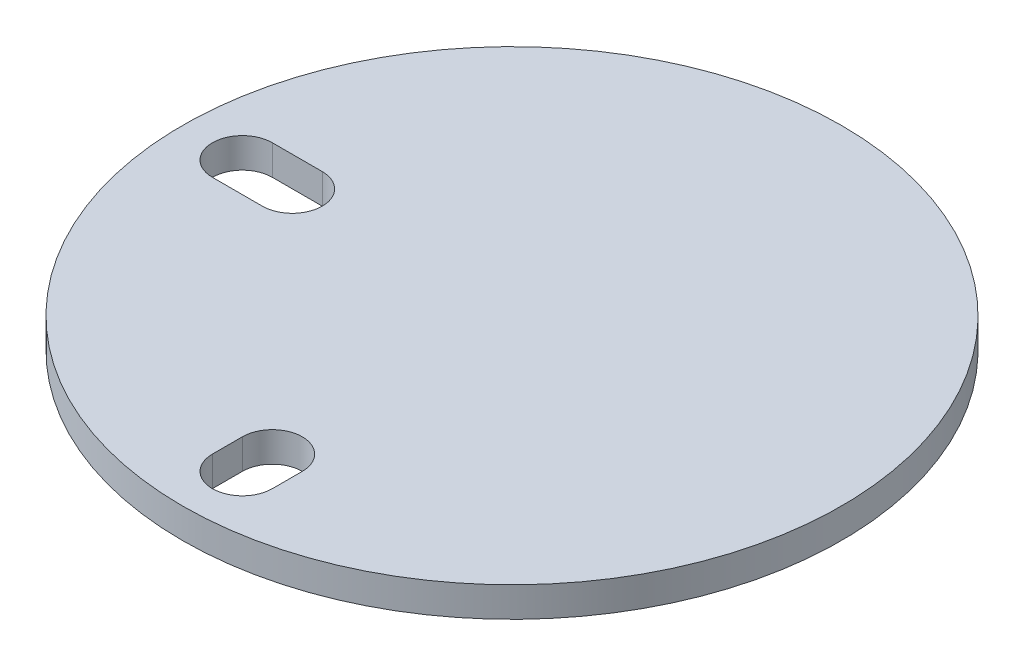
ISO-10303-21;
HEADER;
FILE_DESCRIPTION(('STEP AP214'),'2;1');
FILE_NAME('part.step','',(''),(''),'','','');
FILE_SCHEMA(('AUTOMOTIVE_DESIGN { 1 0 10303 214 1 1 1 1 }'));
ENDSEC;
DATA;
#1=APPLICATION_CONTEXT('core data for automotive mechanical design processes');
#2=APPLICATION_PROTOCOL_DEFINITION('international standard','automotive_design',2000,#1);
#3=PRODUCT_CONTEXT('',#1,'mechanical');
#4=PRODUCT('Part','Part','',(#3));
#5=PRODUCT_RELATED_PRODUCT_CATEGORY('part','',(#4));
#6=PRODUCT_DEFINITION_FORMATION('','',#4);
#7=PRODUCT_DEFINITION_CONTEXT('part definition',#1,'design');
#8=PRODUCT_DEFINITION('design','',#6,#7);
#9=PRODUCT_DEFINITION_SHAPE('','',#8);
#10=(LENGTH_UNIT() NAMED_UNIT(*) SI_UNIT(.MILLI.,.METRE.));
#11=(NAMED_UNIT(*) PLANE_ANGLE_UNIT() SI_UNIT($,.RADIAN.));
#12=(NAMED_UNIT(*) SI_UNIT($,.STERADIAN.) SOLID_ANGLE_UNIT());
#13=UNCERTAINTY_MEASURE_WITH_UNIT(LENGTH_MEASURE(1.E-05),#10,'distance_accuracy_value','');
#14=(GEOMETRIC_REPRESENTATION_CONTEXT(3) GLOBAL_UNCERTAINTY_ASSIGNED_CONTEXT((#13)) GLOBAL_UNIT_ASSIGNED_CONTEXT((#10,
#11,#12)) REPRESENTATION_CONTEXT('',''));
#15=CARTESIAN_POINT('',(0.,0.,0.));
#16=DIRECTION('',(0.,0.,1.));
#17=DIRECTION('',(1.,0.,0.));
#18=AXIS2_PLACEMENT_3D('',#15,#16,#17);
#19=CARTESIAN_POINT('',(0.,3.,0.));
#20=DIRECTION('',(0.,1.,0.));
#21=DIRECTION('',(0.,0.,1.));
#22=AXIS2_PLACEMENT_3D('',#19,#20,#21);
#23=PLANE('',#22);
#24=CARTESIAN_POINT('',(0.,3.,0.));
#25=DIRECTION('',(0.,1.,0.));
#26=DIRECTION('',(0.,0.,1.));
#27=AXIS2_PLACEMENT_3D('',#24,#25,#26);
#28=CIRCLE('',#27,33.);
#29=CARTESIAN_POINT('',(0.,3.,33.));
#30=VERTEX_POINT('',#29);
#31=EDGE_CURVE('E11',#30,#30,#28,.T.);
#32=ORIENTED_EDGE('',*,*,#31,.T.);
#33=EDGE_LOOP('',(#32));
#34=FACE_BOUND('',#33,.T.);
#35=DIRECTION('',(0.999999999033754,0.,-4.39601134094828E-05));
#36=VECTOR('',#35,1.);
#37=CARTESIAN_POINT('',(-27.,3.,3.));
#38=LINE('',#37,#36);
#39=CARTESIAN_POINT('',(-27.,3.,3.));
#40=VERTEX_POINT('',#39);
#41=CARTESIAN_POINT('',(-21.9635532222098,3.,2.99977859722825));
#42=VERTEX_POINT('',#41);
#43=EDGE_CURVE('E136',#40,#42,#38,.T.);
#44=ORIENTED_EDGE('',*,*,#43,.F.);
#45=CARTESIAN_POINT('',(-27.,3.,0.));
#46=DIRECTION('',(0.,1.,0.));
#47=DIRECTION('',(0.,0.,1.));
#48=AXIS2_PLACEMENT_3D('',#45,#46,#47);
#49=CIRCLE('',#48,3.);
#50=CARTESIAN_POINT('',(-27.,3.,-3.));
#51=VERTEX_POINT('',#50);
#52=EDGE_CURVE('E134',#51,#40,#49,.T.);
#53=ORIENTED_EDGE('',*,*,#52,.F.);
#54=DIRECTION('',(-1.,0.,0.));
#55=VECTOR('',#54,1.);
#56=CARTESIAN_POINT('',(-27.,3.,-3.));
#57=LINE('',#56,#55);
#58=CARTESIAN_POINT('',(-22.,3.,-3.));
#59=VERTEX_POINT('',#58);
#60=EDGE_CURVE('E142',#59,#51,#57,.T.);
#61=ORIENTED_EDGE('',*,*,#60,.F.);
#62=CARTESIAN_POINT('',(-22.,3.,0.));
#63=DIRECTION('',(0.,1.,0.));
#64=DIRECTION('',(0.,0.,1.));
#65=AXIS2_PLACEMENT_3D('',#62,#63,#64);
#66=CIRCLE('',#65,3.);
#67=EDGE_CURVE('E139',#42,#59,#66,.T.);
#68=ORIENTED_EDGE('',*,*,#67,.F.);
#69=EDGE_LOOP('',(#44,#53,#61,#68));
#70=FACE_BOUND('',#69,.T.);
#71=DIRECTION('',(0.,0.,-1.));
#72=VECTOR('',#71,1.);
#73=CARTESIAN_POINT('',(3.00000000000001,3.,24.));
#74=LINE('',#73,#72);
#75=CARTESIAN_POINT('',(3.00000000000001,3.,27.));
#76=VERTEX_POINT('',#75);
#77=CARTESIAN_POINT('',(3.00000000000001,3.,24.));
#78=VERTEX_POINT('',#77);
#79=EDGE_CURVE('E106',#76,#78,#74,.T.);
#80=ORIENTED_EDGE('',*,*,#79,.F.);
#81=CARTESIAN_POINT('',(0.,3.,27.));
#82=DIRECTION('',(0.,1.,0.));
#83=DIRECTION('',(0.,0.,1.));
#84=AXIS2_PLACEMENT_3D('',#81,#82,#83);
#85=CIRCLE('',#84,3.);
#86=CARTESIAN_POINT('',(-2.99999999999999,3.,27.));
#87=VERTEX_POINT('',#86);
#88=EDGE_CURVE('E98',#87,#76,#85,.T.);
#89=ORIENTED_EDGE('',*,*,#88,.F.);
#90=DIRECTION('',(0.,0.,1.));
#91=VECTOR('',#90,1.);
#92=CARTESIAN_POINT('',(-2.99999999999999,3.,27.));
#93=LINE('',#92,#91);
#94=CARTESIAN_POINT('',(-2.99999999999999,3.,24.));
#95=VERTEX_POINT('',#94);
#96=EDGE_CURVE('E120',#95,#87,#93,.T.);
#97=ORIENTED_EDGE('',*,*,#96,.F.);
#98=CARTESIAN_POINT('',(0.,3.,24.));
#99=DIRECTION('',(0.,1.,0.));
#100=DIRECTION('',(0.,0.,1.));
#101=AXIS2_PLACEMENT_3D('',#98,#99,#100);
#102=CIRCLE('',#101,3.);
#103=EDGE_CURVE('E118',#78,#95,#102,.T.);
#104=ORIENTED_EDGE('',*,*,#103,.F.);
#105=EDGE_LOOP('',(#80,#89,#97,#104));
#106=FACE_BOUND('',#105,.T.);
#107=ADVANCED_FACE('F33',(#34,#70,#106),#23,.T.);
#108=CARTESIAN_POINT('',(0.,0.,0.));
#109=DIRECTION('',(0.,1.,0.));
#110=DIRECTION('',(0.,0.,1.));
#111=AXIS2_PLACEMENT_3D('',#108,#109,#110);
#112=PLANE('',#111);
#113=CARTESIAN_POINT('',(-27.,0.,0.));
#114=DIRECTION('',(0.,1.,0.));
#115=DIRECTION('',(0.,0.,1.));
#116=AXIS2_PLACEMENT_3D('',#113,#114,#115);
#117=CIRCLE('',#116,3.);
#118=CARTESIAN_POINT('',(-27.,0.,-3.));
#119=VERTEX_POINT('',#118);
#120=CARTESIAN_POINT('',(-27.,0.,3.));
#121=VERTEX_POINT('',#120);
#122=EDGE_CURVE('E114',#119,#121,#117,.T.);
#123=ORIENTED_EDGE('',*,*,#122,.T.);
#124=DIRECTION('',(0.999999999033754,0.,-4.39601134094828E-05));
#125=VECTOR('',#124,1.);
#126=CARTESIAN_POINT('',(-27.,0.,3.));
#127=LINE('',#126,#125);
#128=CARTESIAN_POINT('',(-21.9635532222098,0.,2.99977859722825));
#129=VERTEX_POINT('',#128);
#130=EDGE_CURVE('E147',#121,#129,#127,.T.);
#131=ORIENTED_EDGE('',*,*,#130,.T.);
#132=CARTESIAN_POINT('',(-22.,0.,0.));
#133=DIRECTION('',(0.,1.,0.));
#134=DIRECTION('',(0.,0.,1.));
#135=AXIS2_PLACEMENT_3D('',#132,#133,#134);
#136=CIRCLE('',#135,3.);
#137=CARTESIAN_POINT('',(-22.,0.,-3.));
#138=VERTEX_POINT('',#137);
#139=EDGE_CURVE('E150',#129,#138,#136,.T.);
#140=ORIENTED_EDGE('',*,*,#139,.T.);
#141=DIRECTION('',(-1.,0.,0.));
#142=VECTOR('',#141,1.);
#143=CARTESIAN_POINT('',(-27.,0.,-3.));
#144=LINE('',#143,#142);
#145=EDGE_CURVE('E137',#138,#119,#144,.T.);
#146=ORIENTED_EDGE('',*,*,#145,.T.);
#147=EDGE_LOOP('',(#123,#131,#140,#146));
#148=FACE_BOUND('',#147,.T.);
#149=CARTESIAN_POINT('',(0.,0.,0.));
#150=DIRECTION('',(0.,1.,0.));
#151=DIRECTION('',(0.,0.,1.));
#152=AXIS2_PLACEMENT_3D('',#149,#150,#151);
#153=CIRCLE('',#152,33.);
#154=CARTESIAN_POINT('',(0.,0.,33.));
#155=VERTEX_POINT('',#154);
#156=EDGE_CURVE('E37',#155,#155,#153,.T.);
#157=ORIENTED_EDGE('',*,*,#156,.F.);
#158=EDGE_LOOP('',(#157));
#159=FACE_BOUND('',#158,.T.);
#160=CARTESIAN_POINT('',(0.,0.,27.));
#161=DIRECTION('',(0.,1.,0.));
#162=DIRECTION('',(0.,0.,1.));
#163=AXIS2_PLACEMENT_3D('',#160,#161,#162);
#164=CIRCLE('',#163,3.);
#165=CARTESIAN_POINT('',(-2.99999999999999,0.,27.));
#166=VERTEX_POINT('',#165);
#167=CARTESIAN_POINT('',(3.00000000000001,0.,27.));
#168=VERTEX_POINT('',#167);
#169=EDGE_CURVE('E56',#166,#168,#164,.T.);
#170=ORIENTED_EDGE('',*,*,#169,.T.);
#171=DIRECTION('',(0.,0.,-1.));
#172=VECTOR('',#171,1.);
#173=CARTESIAN_POINT('',(3.00000000000001,0.,24.));
#174=LINE('',#173,#172);
#175=CARTESIAN_POINT('',(3.00000000000001,0.,24.));
#176=VERTEX_POINT('',#175);
#177=EDGE_CURVE('E113',#168,#176,#174,.T.);
#178=ORIENTED_EDGE('',*,*,#177,.T.);
#179=CARTESIAN_POINT('',(0.,0.,24.));
#180=DIRECTION('',(0.,1.,0.));
#181=DIRECTION('',(0.,0.,1.));
#182=AXIS2_PLACEMENT_3D('',#179,#180,#181);
#183=CIRCLE('',#182,3.);
#184=CARTESIAN_POINT('',(-2.99999999999999,0.,24.));
#185=VERTEX_POINT('',#184);
#186=EDGE_CURVE('E126',#176,#185,#183,.T.);
#187=ORIENTED_EDGE('',*,*,#186,.T.);
#188=DIRECTION('',(0.,0.,1.));
#189=VECTOR('',#188,1.);
#190=CARTESIAN_POINT('',(-2.99999999999999,0.,27.));
#191=LINE('',#190,#189);
#192=EDGE_CURVE('E107',#185,#166,#191,.T.);
#193=ORIENTED_EDGE('',*,*,#192,.T.);
#194=EDGE_LOOP('',(#170,#178,#187,#193));
#195=FACE_BOUND('',#194,.T.);
#196=ADVANCED_FACE('F169',(#148,#159,#195),#112,.F.);
#197=CARTESIAN_POINT('',(0.,3.,0.));
#198=DIRECTION('',(0.,-1.,0.));
#199=DIRECTION('',(0.,0.,-1.));
#200=AXIS2_PLACEMENT_3D('',#197,#198,#199);
#201=CYLINDRICAL_SURFACE('',#200,33.);
#202=ORIENTED_EDGE('',*,*,#31,.F.);
#203=EDGE_LOOP('',(#202));
#204=FACE_BOUND('',#203,.T.);
#205=ORIENTED_EDGE('',*,*,#156,.T.);
#206=EDGE_LOOP('',(#205));
#207=FACE_BOUND('',#206,.T.);
#208=ADVANCED_FACE('F35',(#204,#207),#201,.T.);
#209=CARTESIAN_POINT('',(-27.,3.,0.));
#210=DIRECTION('',(0.,-1.,0.));
#211=DIRECTION('',(0.,0.,-1.));
#212=AXIS2_PLACEMENT_3D('',#209,#210,#211);
#213=CYLINDRICAL_SURFACE('',#212,3.);
#214=ORIENTED_EDGE('',*,*,#122,.F.);
#215=DIRECTION('',(0.,-1.,0.));
#216=VECTOR('',#215,1.);
#217=CARTESIAN_POINT('',(-27.,3.,-3.));
#218=LINE('',#217,#216);
#219=EDGE_CURVE('E144',#51,#119,#218,.T.);
#220=ORIENTED_EDGE('',*,*,#219,.F.);
#221=ORIENTED_EDGE('',*,*,#52,.T.);
#222=DIRECTION('',(0.,-1.,0.));
#223=VECTOR('',#222,1.);
#224=CARTESIAN_POINT('',(-27.,3.,3.));
#225=LINE('',#224,#223);
#226=EDGE_CURVE('E161',#40,#121,#225,.T.);
#227=ORIENTED_EDGE('',*,*,#226,.T.);
#228=EDGE_LOOP('',(#214,#220,#221,#227));
#229=FACE_BOUND('',#228,.T.);
#230=ADVANCED_FACE('F190',(#229),#213,.F.);
#231=CARTESIAN_POINT('',(-27.,3.,3.));
#232=DIRECTION('',(-4.39601134094828E-05,0.,-0.999999999033754));
#233=DIRECTION('',(-0.999999999033754,0.,4.39601134094828E-05));
#234=AXIS2_PLACEMENT_3D('',#231,#232,#233);
#235=PLANE('',#234);
#236=ORIENTED_EDGE('',*,*,#130,.F.);
#237=ORIENTED_EDGE('',*,*,#226,.F.);
#238=ORIENTED_EDGE('',*,*,#43,.T.);
#239=DIRECTION('',(0.,-1.,0.));
#240=VECTOR('',#239,1.);
#241=CARTESIAN_POINT('',(-21.9635532222098,3.,2.99977859722825));
#242=LINE('',#241,#240);
#243=EDGE_CURVE('E159',#42,#129,#242,.T.);
#244=ORIENTED_EDGE('',*,*,#243,.T.);
#245=EDGE_LOOP('',(#236,#237,#238,#244));
#246=FACE_BOUND('',#245,.T.);
#247=ADVANCED_FACE('F193',(#246),#235,.T.);
#248=CARTESIAN_POINT('',(-22.,3.,0.));
#249=DIRECTION('',(0.,-1.,0.));
#250=DIRECTION('',(0.,0.,-1.));
#251=AXIS2_PLACEMENT_3D('',#248,#249,#250);
#252=CYLINDRICAL_SURFACE('',#251,3.);
#253=ORIENTED_EDGE('',*,*,#139,.F.);
#254=ORIENTED_EDGE('',*,*,#243,.F.);
#255=ORIENTED_EDGE('',*,*,#67,.T.);
#256=DIRECTION('',(0.,-1.,0.));
#257=VECTOR('',#256,1.);
#258=CARTESIAN_POINT('',(-22.,3.,-3.));
#259=LINE('',#258,#257);
#260=EDGE_CURVE('E157',#59,#138,#259,.T.);
#261=ORIENTED_EDGE('',*,*,#260,.T.);
#262=EDGE_LOOP('',(#253,#254,#255,#261));
#263=FACE_BOUND('',#262,.T.);
#264=ADVANCED_FACE('F196',(#263),#252,.F.);
#265=CARTESIAN_POINT('',(-27.,3.,-3.));
#266=DIRECTION('',(0.,0.,1.));
#267=DIRECTION('',(1.,0.,0.));
#268=AXIS2_PLACEMENT_3D('',#265,#266,#267);
#269=PLANE('',#268);
#270=ORIENTED_EDGE('',*,*,#145,.F.);
#271=ORIENTED_EDGE('',*,*,#260,.F.);
#272=ORIENTED_EDGE('',*,*,#60,.T.);
#273=ORIENTED_EDGE('',*,*,#219,.T.);
#274=EDGE_LOOP('',(#270,#271,#272,#273));
#275=FACE_BOUND('',#274,.T.);
#276=ADVANCED_FACE('F200',(#275),#269,.T.);
#277=CARTESIAN_POINT('',(0.,3.,27.));
#278=DIRECTION('',(0.,-1.,0.));
#279=DIRECTION('',(0.,0.,-1.));
#280=AXIS2_PLACEMENT_3D('',#277,#278,#279);
#281=CYLINDRICAL_SURFACE('',#280,3.);
#282=ORIENTED_EDGE('',*,*,#169,.F.);
#283=DIRECTION('',(0.,-1.,0.));
#284=VECTOR('',#283,1.);
#285=CARTESIAN_POINT('',(-2.99999999999999,3.,27.));
#286=LINE('',#285,#284);
#287=EDGE_CURVE('E102',#87,#166,#286,.T.);
#288=ORIENTED_EDGE('',*,*,#287,.F.);
#289=ORIENTED_EDGE('',*,*,#88,.T.);
#290=DIRECTION('',(0.,-1.,0.));
#291=VECTOR('',#290,1.);
#292=CARTESIAN_POINT('',(3.00000000000001,3.,27.));
#293=LINE('',#292,#291);
#294=EDGE_CURVE('E101',#76,#168,#293,.T.);
#295=ORIENTED_EDGE('',*,*,#294,.T.);
#296=EDGE_LOOP('',(#282,#288,#289,#295));
#297=FACE_BOUND('',#296,.T.);
#298=ADVANCED_FACE('F100',(#297),#281,.F.);
#299=CARTESIAN_POINT('',(3.00000000000001,3.,24.));
#300=DIRECTION('',(-1.,0.,0.));
#301=DIRECTION('',(0.,0.,1.));
#302=AXIS2_PLACEMENT_3D('',#299,#300,#301);
#303=PLANE('',#302);
#304=ORIENTED_EDGE('',*,*,#177,.F.);
#305=ORIENTED_EDGE('',*,*,#294,.F.);
#306=ORIENTED_EDGE('',*,*,#79,.T.);
#307=DIRECTION('',(0.,-1.,0.));
#308=VECTOR('',#307,1.);
#309=CARTESIAN_POINT('',(3.00000000000001,3.,24.));
#310=LINE('',#309,#308);
#311=EDGE_CURVE('E115',#78,#176,#310,.T.);
#312=ORIENTED_EDGE('',*,*,#311,.T.);
#313=EDGE_LOOP('',(#304,#305,#306,#312));
#314=FACE_BOUND('',#313,.T.);
#315=ADVANCED_FACE('F110',(#314),#303,.T.);
#316=CARTESIAN_POINT('',(0.,3.,24.));
#317=DIRECTION('',(0.,-1.,0.));
#318=DIRECTION('',(0.,0.,-1.));
#319=AXIS2_PLACEMENT_3D('',#316,#317,#318);
#320=CYLINDRICAL_SURFACE('',#319,3.);
#321=ORIENTED_EDGE('',*,*,#186,.F.);
#322=ORIENTED_EDGE('',*,*,#311,.F.);
#323=ORIENTED_EDGE('',*,*,#103,.T.);
#324=DIRECTION('',(0.,-1.,0.));
#325=VECTOR('',#324,1.);
#326=CARTESIAN_POINT('',(-2.99999999999999,3.,24.));
#327=LINE('',#326,#325);
#328=EDGE_CURVE('E48',#95,#185,#327,.T.);
#329=ORIENTED_EDGE('',*,*,#328,.T.);
#330=EDGE_LOOP('',(#321,#322,#323,#329));
#331=FACE_BOUND('',#330,.T.);
#332=ADVANCED_FACE('F176',(#331),#320,.F.);
#333=CARTESIAN_POINT('',(-2.99999999999999,3.,27.));
#334=DIRECTION('',(1.,0.,0.));
#335=DIRECTION('',(0.,0.,-1.));
#336=AXIS2_PLACEMENT_3D('',#333,#334,#335);
#337=PLANE('',#336);
#338=ORIENTED_EDGE('',*,*,#192,.F.);
#339=ORIENTED_EDGE('',*,*,#328,.F.);
#340=ORIENTED_EDGE('',*,*,#96,.T.);
#341=ORIENTED_EDGE('',*,*,#287,.T.);
#342=EDGE_LOOP('',(#338,#339,#340,#341));
#343=FACE_BOUND('',#342,.T.);
#344=ADVANCED_FACE('F174',(#343),#337,.T.);
#345=CLOSED_SHELL('',(#107,#196,#208,#230,#247,#264,#276,#298,#315,#332,#344));
#346=MANIFOLD_SOLID_BREP('B2',#345);
#347=ADVANCED_BREP_SHAPE_REPRESENTATION('',(#18,#346),#14);
#348=SHAPE_DEFINITION_REPRESENTATION(#9,#347);
ENDSEC;
END-ISO-10303-21;
